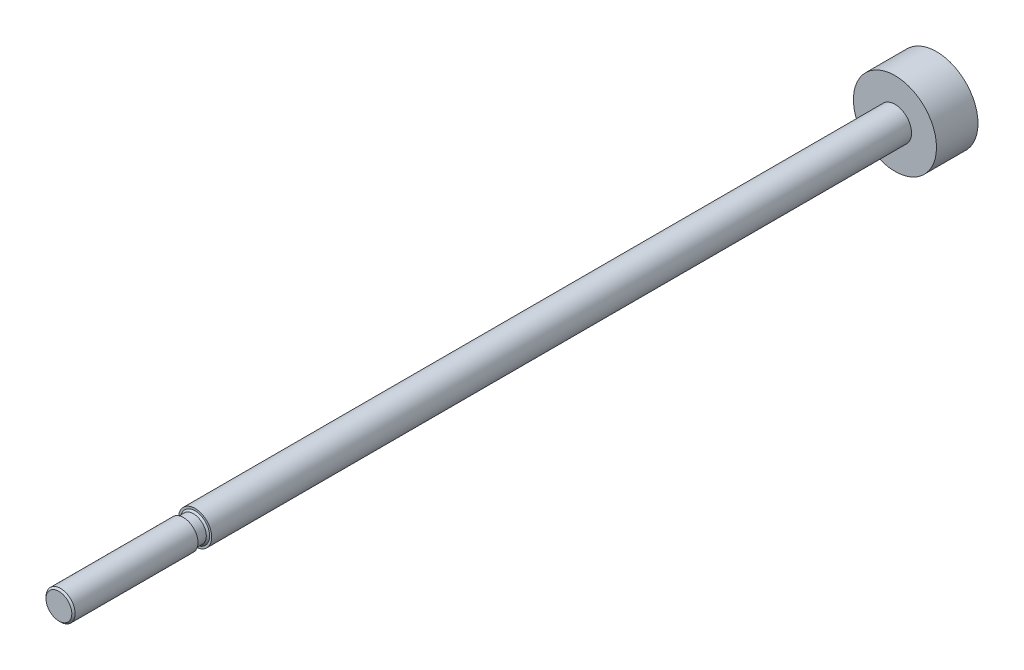
ISO-10303-21;
HEADER;
FILE_DESCRIPTION(('STEP AP214'),'2;1');
FILE_NAME('part.step','',(''),(''),'','','');
FILE_SCHEMA(('AUTOMOTIVE_DESIGN { 1 0 10303 214 1 1 1 1 }'));
ENDSEC;
DATA;
#1=APPLICATION_CONTEXT('core data for automotive mechanical design processes');
#2=APPLICATION_PROTOCOL_DEFINITION('international standard','automotive_design',2000,#1);
#3=PRODUCT_CONTEXT('',#1,'mechanical');
#4=PRODUCT('Part','Part','',(#3));
#5=PRODUCT_RELATED_PRODUCT_CATEGORY('part','',(#4));
#6=PRODUCT_DEFINITION_FORMATION('','',#4);
#7=PRODUCT_DEFINITION_CONTEXT('part definition',#1,'design');
#8=PRODUCT_DEFINITION('design','',#6,#7);
#9=PRODUCT_DEFINITION_SHAPE('','',#8);
#10=(LENGTH_UNIT() NAMED_UNIT(*) SI_UNIT(.MILLI.,.METRE.));
#11=(NAMED_UNIT(*) PLANE_ANGLE_UNIT() SI_UNIT($,.RADIAN.));
#12=(NAMED_UNIT(*) SI_UNIT($,.STERADIAN.) SOLID_ANGLE_UNIT());
#13=UNCERTAINTY_MEASURE_WITH_UNIT(LENGTH_MEASURE(1.E-05),#10,'distance_accuracy_value','');
#14=(GEOMETRIC_REPRESENTATION_CONTEXT(3) GLOBAL_UNCERTAINTY_ASSIGNED_CONTEXT((#13)) GLOBAL_UNIT_ASSIGNED_CONTEXT((#10,
#11,#12)) REPRESENTATION_CONTEXT('',''));
#15=CARTESIAN_POINT('',(0.,0.,0.));
#16=DIRECTION('',(0.,0.,1.));
#17=DIRECTION('',(1.,0.,0.));
#18=AXIS2_PLACEMENT_3D('',#15,#16,#17);
#19=CARTESIAN_POINT('',(0.,0.,2.5));
#20=DIRECTION('',(0.,0.,1.));
#21=DIRECTION('',(1.,0.,0.));
#22=AXIS2_PLACEMENT_3D('',#19,#20,#21);
#23=PLANE('',#22);
#24=CARTESIAN_POINT('',(0.,0.,2.5));
#25=DIRECTION('',(0.,0.,1.));
#26=DIRECTION('',(1.,0.,0.));
#27=AXIS2_PLACEMENT_3D('',#24,#25,#26);
#28=CIRCLE('',#27,5.);
#29=CARTESIAN_POINT('',(5.,0.,2.5));
#30=VERTEX_POINT('',#29);
#31=EDGE_CURVE('E42',#30,#30,#28,.T.);
#32=ORIENTED_EDGE('',*,*,#31,.T.);
#33=EDGE_LOOP('',(#32));
#34=FACE_BOUND('',#33,.T.);
#35=CARTESIAN_POINT('',(0.,0.,2.5));
#36=DIRECTION('',(0.,0.,1.));
#37=DIRECTION('',(1.,0.,0.));
#38=AXIS2_PLACEMENT_3D('',#35,#36,#37);
#39=CIRCLE('',#38,2.);
#40=CARTESIAN_POINT('',(2.,0.,2.5));
#41=VERTEX_POINT('',#40);
#42=EDGE_CURVE('E10',#41,#41,#39,.T.);
#43=ORIENTED_EDGE('',*,*,#42,.F.);
#44=EDGE_LOOP('',(#43));
#45=FACE_BOUND('',#44,.T.);
#46=ADVANCED_FACE('F34',(#34,#45),#23,.T.);
#47=CARTESIAN_POINT('',(0.,0.,2.5));
#48=DIRECTION('',(0.,0.,-1.));
#49=DIRECTION('',(-1.,0.,0.));
#50=AXIS2_PLACEMENT_3D('',#47,#48,#49);
#51=CYLINDRICAL_SURFACE('',#50,5.);
#52=ORIENTED_EDGE('',*,*,#31,.F.);
#53=EDGE_LOOP('',(#52));
#54=FACE_BOUND('',#53,.T.);
#55=CARTESIAN_POINT('',(0.,0.,-2.5));
#56=DIRECTION('',(0.,0.,1.));
#57=DIRECTION('',(1.,0.,0.));
#58=AXIS2_PLACEMENT_3D('',#55,#56,#57);
#59=CIRCLE('',#58,5.);
#60=CARTESIAN_POINT('',(5.,0.,-2.5));
#61=VERTEX_POINT('',#60);
#62=EDGE_CURVE('E46',#61,#61,#59,.T.);
#63=ORIENTED_EDGE('',*,*,#62,.T.);
#64=EDGE_LOOP('',(#63));
#65=FACE_BOUND('',#64,.T.);
#66=ADVANCED_FACE('F109',(#54,#65),#51,.T.);
#67=CARTESIAN_POINT('',(0.,0.,-2.5));
#68=DIRECTION('',(0.,0.,1.));
#69=DIRECTION('',(1.,0.,0.));
#70=AXIS2_PLACEMENT_3D('',#67,#68,#69);
#71=PLANE('',#70);
#72=ORIENTED_EDGE('',*,*,#62,.F.);
#73=EDGE_LOOP('',(#72));
#74=FACE_BOUND('',#73,.T.);
#75=ADVANCED_FACE('F115',(#74),#71,.F.);
#76=CARTESIAN_POINT('',(0.,0.,108.841854249492));
#77=DIRECTION('',(0.,0.,-1.));
#78=DIRECTION('',(-1.,0.,0.));
#79=AXIS2_PLACEMENT_3D('',#76,#77,#78);
#80=CYLINDRICAL_SURFACE('',#79,2.);
#81=CARTESIAN_POINT('',(0.,0.,86.785));
#82=DIRECTION('',(0.,0.,-1.));
#83=DIRECTION('',(-1.,0.,0.));
#84=AXIS2_PLACEMENT_3D('',#81,#82,#83);
#85=CIRCLE('',#84,2.);
#86=CARTESIAN_POINT('',(-2.,0.,86.785));
#87=VERTEX_POINT('',#86);
#88=EDGE_CURVE('E38',#87,#87,#85,.T.);
#89=ORIENTED_EDGE('',*,*,#88,.T.);
#90=EDGE_LOOP('',(#89));
#91=FACE_BOUND('',#90,.T.);
#92=ORIENTED_EDGE('',*,*,#42,.T.);
#93=EDGE_LOOP('',(#92));
#94=FACE_BOUND('',#93,.T.);
#95=ADVANCED_FACE('F36',(#91,#94),#80,.T.);
#96=CARTESIAN_POINT('',(0.,1.75000000000001,86.785));
#97=DIRECTION('',(0.,0.,-1.));
#98=DIRECTION('',(-1.,0.,0.));
#99=AXIS2_PLACEMENT_3D('',#96,#97,#98);
#100=PLANE('',#99);
#101=CARTESIAN_POINT('',(0.,0.,86.785));
#102=DIRECTION('',(0.,0.,-1.));
#103=DIRECTION('',(-1.,0.,0.));
#104=AXIS2_PLACEMENT_3D('',#101,#102,#103);
#105=CIRCLE('',#104,1.75000000000001);
#106=CARTESIAN_POINT('',(-1.75000000000001,0.,86.785));
#107=VERTEX_POINT('',#106);
#108=EDGE_CURVE('E66',#107,#107,#105,.T.);
#109=ORIENTED_EDGE('',*,*,#108,.T.);
#110=EDGE_LOOP('',(#109));
#111=FACE_BOUND('',#110,.T.);
#112=ORIENTED_EDGE('',*,*,#88,.F.);
#113=EDGE_LOOP('',(#112));
#114=FACE_BOUND('',#113,.T.);
#115=ADVANCED_FACE('F70',(#111,#114),#100,.F.);
#116=CARTESIAN_POINT('',(0.,0.,103.185));
#117=DIRECTION('',(0.,0.,-1.));
#118=DIRECTION('',(-1.,0.,0.));
#119=AXIS2_PLACEMENT_3D('',#116,#117,#118);
#120=CONICAL_SURFACE('',#119,1.55249999999998,0.785398163397415);
#121=CARTESIAN_POINT('',(0.,0.,102.985));
#122=DIRECTION('',(0.,0.,-1.));
#123=DIRECTION('',(-1.,0.,0.));
#124=AXIS2_PLACEMENT_3D('',#121,#122,#123);
#125=CIRCLE('',#124,1.75249999999999);
#126=CARTESIAN_POINT('',(-1.75249999999999,0.,102.985));
#127=VERTEX_POINT('',#126);
#128=EDGE_CURVE('E54',#127,#127,#125,.T.);
#129=ORIENTED_EDGE('',*,*,#128,.F.);
#130=EDGE_LOOP('',(#129));
#131=FACE_BOUND('',#130,.T.);
#132=CARTESIAN_POINT('',(0.,0.,103.185));
#133=DIRECTION('',(0.,0.,-1.));
#134=DIRECTION('',(-1.,0.,0.));
#135=AXIS2_PLACEMENT_3D('',#132,#133,#134);
#136=CIRCLE('',#135,1.55249999999998);
#137=CARTESIAN_POINT('',(-1.55249999999998,0.,103.185));
#138=VERTEX_POINT('',#137);
#139=EDGE_CURVE('E51',#138,#138,#136,.T.);
#140=ORIENTED_EDGE('',*,*,#139,.T.);
#141=EDGE_LOOP('',(#140));
#142=FACE_BOUND('',#141,.T.);
#143=ADVANCED_FACE('F95',(#131,#142),#120,.T.);
#144=CARTESIAN_POINT('',(0.,0.,0.));
#145=DIRECTION('',(0.,0.,-1.));
#146=DIRECTION('',(-1.,0.,0.));
#147=AXIS2_PLACEMENT_3D('',#144,#145,#146);
#148=CYLINDRICAL_SURFACE('',#147,1.75249999999999);
#149=CARTESIAN_POINT('',(0.,0.,88.185));
#150=DIRECTION('',(0.,0.,-1.));
#151=DIRECTION('',(-1.,0.,0.));
#152=AXIS2_PLACEMENT_3D('',#149,#150,#151);
#153=CIRCLE('',#152,1.75249999999999);
#154=CARTESIAN_POINT('',(-1.75249999999999,0.,88.185));
#155=VERTEX_POINT('',#154);
#156=EDGE_CURVE('E57',#155,#155,#153,.T.);
#157=ORIENTED_EDGE('',*,*,#156,.F.);
#158=EDGE_LOOP('',(#157));
#159=FACE_BOUND('',#158,.T.);
#160=ORIENTED_EDGE('',*,*,#128,.T.);
#161=EDGE_LOOP('',(#160));
#162=FACE_BOUND('',#161,.T.);
#163=ADVANCED_FACE('F89',(#159,#162),#148,.T.);
#164=CARTESIAN_POINT('',(0.,1.75249999999999,88.185));
#165=DIRECTION('',(0.,0.,1.));
#166=DIRECTION('',(1.,0.,0.));
#167=AXIS2_PLACEMENT_3D('',#164,#165,#166);
#168=PLANE('',#167);
#169=CARTESIAN_POINT('',(0.,0.,88.185));
#170=DIRECTION('',(0.,0.,-1.));
#171=DIRECTION('',(-1.,0.,0.));
#172=AXIS2_PLACEMENT_3D('',#169,#170,#171);
#173=CIRCLE('',#172,1.54999999999999);
#174=CARTESIAN_POINT('',(-1.54999999999999,0.,88.185));
#175=VERTEX_POINT('',#174);
#176=EDGE_CURVE('E60',#175,#175,#173,.T.);
#177=ORIENTED_EDGE('',*,*,#176,.F.);
#178=EDGE_LOOP('',(#177));
#179=FACE_BOUND('',#178,.T.);
#180=ORIENTED_EDGE('',*,*,#156,.T.);
#181=EDGE_LOOP('',(#180));
#182=FACE_BOUND('',#181,.T.);
#183=ADVANCED_FACE('F83',(#179,#182),#168,.F.);
#184=CARTESIAN_POINT('',(0.,0.,0.));
#185=DIRECTION('',(0.,0.,-1.));
#186=DIRECTION('',(-1.,0.,0.));
#187=AXIS2_PLACEMENT_3D('',#184,#185,#186);
#188=CYLINDRICAL_SURFACE('',#187,1.54999999999999);
#189=CARTESIAN_POINT('',(0.,0.,86.985));
#190=DIRECTION('',(0.,0.,-1.));
#191=DIRECTION('',(-1.,0.,0.));
#192=AXIS2_PLACEMENT_3D('',#189,#190,#191);
#193=CIRCLE('',#192,1.54999999999999);
#194=CARTESIAN_POINT('',(-1.54999999999999,0.,86.985));
#195=VERTEX_POINT('',#194);
#196=EDGE_CURVE('E63',#195,#195,#193,.T.);
#197=ORIENTED_EDGE('',*,*,#196,.F.);
#198=EDGE_LOOP('',(#197));
#199=FACE_BOUND('',#198,.T.);
#200=ORIENTED_EDGE('',*,*,#176,.T.);
#201=EDGE_LOOP('',(#200));
#202=FACE_BOUND('',#201,.T.);
#203=ADVANCED_FACE('F77',(#199,#202),#188,.T.);
#204=CARTESIAN_POINT('',(0.,0.,86.985));
#205=DIRECTION('',(0.,0.,-1.));
#206=DIRECTION('',(-1.,0.,0.));
#207=AXIS2_PLACEMENT_3D('',#204,#205,#206);
#208=CONICAL_SURFACE('',#207,1.54999999999999,0.785398163397469);
#209=ORIENTED_EDGE('',*,*,#108,.F.);
#210=EDGE_LOOP('',(#209));
#211=FACE_BOUND('',#210,.T.);
#212=ORIENTED_EDGE('',*,*,#196,.T.);
#213=EDGE_LOOP('',(#212));
#214=FACE_BOUND('',#213,.T.);
#215=ADVANCED_FACE('F73',(#211,#214),#208,.T.);
#216=CARTESIAN_POINT('',(0.,0.,103.185));
#217=DIRECTION('',(0.,0.,-1.));
#218=DIRECTION('',(-1.,0.,0.));
#219=AXIS2_PLACEMENT_3D('',#216,#217,#218);
#220=PLANE('',#219);
#221=ORIENTED_EDGE('',*,*,#139,.F.);
#222=EDGE_LOOP('',(#221));
#223=FACE_BOUND('',#222,.T.);
#224=ADVANCED_FACE('F76',(#223),#220,.F.);
#225=CLOSED_SHELL('',(#46,#66,#75,#95,#115,#143,#163,#183,#203,#215,#224));
#226=MANIFOLD_SOLID_BREP('B2',#225);
#227=ADVANCED_BREP_SHAPE_REPRESENTATION('',(#18,#226),#14);
#228=SHAPE_DEFINITION_REPRESENTATION(#9,#227);
ENDSEC;
END-ISO-10303-21;
